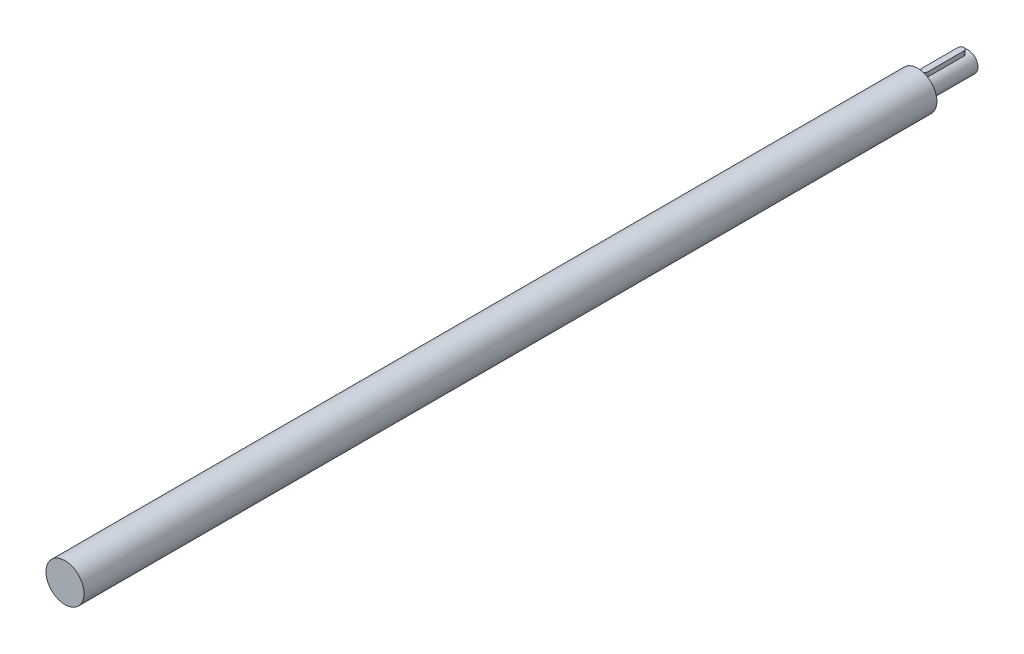
ISO-10303-21;
HEADER;
FILE_DESCRIPTION(('STEP AP214'),'2;1');
FILE_NAME('part.step','',(''),(''),'','','');
FILE_SCHEMA(('AUTOMOTIVE_DESIGN { 1 0 10303 214 1 1 1 1 }'));
ENDSEC;
DATA;
#1=APPLICATION_CONTEXT('core data for automotive mechanical design processes');
#2=APPLICATION_PROTOCOL_DEFINITION('international standard','automotive_design',2000,#1);
#3=PRODUCT_CONTEXT('',#1,'mechanical');
#4=PRODUCT('Part','Part','',(#3));
#5=PRODUCT_RELATED_PRODUCT_CATEGORY('part','',(#4));
#6=PRODUCT_DEFINITION_FORMATION('','',#4);
#7=PRODUCT_DEFINITION_CONTEXT('part definition',#1,'design');
#8=PRODUCT_DEFINITION('design','',#6,#7);
#9=PRODUCT_DEFINITION_SHAPE('','',#8);
#10=(LENGTH_UNIT() NAMED_UNIT(*) SI_UNIT(.MILLI.,.METRE.));
#11=(NAMED_UNIT(*) PLANE_ANGLE_UNIT() SI_UNIT($,.RADIAN.));
#12=(NAMED_UNIT(*) SI_UNIT($,.STERADIAN.) SOLID_ANGLE_UNIT());
#13=UNCERTAINTY_MEASURE_WITH_UNIT(LENGTH_MEASURE(1.E-05),#10,'distance_accuracy_value','');
#14=(GEOMETRIC_REPRESENTATION_CONTEXT(3) GLOBAL_UNCERTAINTY_ASSIGNED_CONTEXT((#13)) GLOBAL_UNIT_ASSIGNED_CONTEXT((#10,
#11,#12)) REPRESENTATION_CONTEXT('',''));
#15=CARTESIAN_POINT('',(0.,0.,0.));
#16=DIRECTION('',(0.,0.,1.));
#17=DIRECTION('',(1.,0.,0.));
#18=AXIS2_PLACEMENT_3D('',#15,#16,#17);
#19=CARTESIAN_POINT('',(0.,0.,425.));
#20=DIRECTION('',(0.,0.,-1.));
#21=DIRECTION('',(-1.,0.,0.));
#22=AXIS2_PLACEMENT_3D('',#19,#20,#21);
#23=CYLINDRICAL_SURFACE('',#22,9.5);
#24=CARTESIAN_POINT('',(0.,0.,425.));
#25=DIRECTION('',(0.,0.,1.));
#26=DIRECTION('',(1.,0.,0.));
#27=AXIS2_PLACEMENT_3D('',#24,#25,#26);
#28=CIRCLE('',#27,9.5);
#29=CARTESIAN_POINT('',(9.5,0.,425.));
#30=VERTEX_POINT('',#29);
#31=EDGE_CURVE('E172',#30,#30,#28,.T.);
#32=ORIENTED_EDGE('',*,*,#31,.F.);
#33=EDGE_LOOP('',(#32));
#34=FACE_BOUND('',#33,.T.);
#35=CARTESIAN_POINT('',(0.,0.,0.));
#36=DIRECTION('',(0.,0.,1.));
#37=DIRECTION('',(1.,0.,0.));
#38=AXIS2_PLACEMENT_3D('',#35,#36,#37);
#39=CIRCLE('',#38,9.5);
#40=CARTESIAN_POINT('',(9.5,0.,0.));
#41=VERTEX_POINT('',#40);
#42=EDGE_CURVE('E168',#41,#41,#39,.T.);
#43=ORIENTED_EDGE('',*,*,#42,.T.);
#44=EDGE_LOOP('',(#43));
#45=FACE_BOUND('',#44,.T.);
#46=ADVANCED_FACE('F32',(#34,#45),#23,.T.);
#47=CARTESIAN_POINT('',(0.,0.,425.));
#48=DIRECTION('',(0.,0.,1.));
#49=DIRECTION('',(1.,0.,0.));
#50=AXIS2_PLACEMENT_3D('',#47,#48,#49);
#51=PLANE('',#50);
#52=ORIENTED_EDGE('',*,*,#31,.T.);
#53=EDGE_LOOP('',(#52));
#54=FACE_BOUND('',#53,.T.);
#55=ADVANCED_FACE('F187',(#54),#51,.T.);
#56=CARTESIAN_POINT('',(0.,0.,0.));
#57=DIRECTION('',(0.,0.,1.));
#58=DIRECTION('',(1.,0.,0.));
#59=AXIS2_PLACEMENT_3D('',#56,#57,#58);
#60=PLANE('',#59);
#61=CARTESIAN_POINT('',(0.,0.,0.));
#62=DIRECTION('',(0.,0.,-1.));
#63=DIRECTION('',(-1.,0.,0.));
#64=AXIS2_PLACEMENT_3D('',#61,#62,#63);
#65=CIRCLE('',#64,5.);
#66=CARTESIAN_POINT('',(-5.,0.,0.));
#67=VERTEX_POINT('',#66);
#68=EDGE_CURVE('E169',#67,#67,#65,.T.);
#69=ORIENTED_EDGE('',*,*,#68,.F.);
#70=EDGE_LOOP('',(#69));
#71=FACE_BOUND('',#70,.T.);
#72=ORIENTED_EDGE('',*,*,#42,.F.);
#73=EDGE_LOOP('',(#72));
#74=FACE_BOUND('',#73,.T.);
#75=ADVANCED_FACE('F192',(#71,#74),#60,.F.);
#76=CARTESIAN_POINT('',(0.,0.,-25.));
#77=DIRECTION('',(0.,0.,1.));
#78=DIRECTION('',(1.,0.,0.));
#79=AXIS2_PLACEMENT_3D('',#76,#77,#78);
#80=CYLINDRICAL_SURFACE('',#79,5.);
#81=DIRECTION('',(0.,0.,1.));
#82=VECTOR('',#81,1.);
#83=CARTESIAN_POINT('',(-1.5,4.76969600708473,-25.));
#84=LINE('',#83,#82);
#85=CARTESIAN_POINT('',(-1.5,4.76969600708473,-21.5));
#86=VERTEX_POINT('',#85);
#87=CARTESIAN_POINT('',(-1.5,4.76969600708473,-3.5));
#88=VERTEX_POINT('',#87);
#89=EDGE_CURVE('E94',#86,#88,#84,.T.);
#90=ORIENTED_EDGE('',*,*,#89,.F.);
#91=CARTESIAN_POINT('',(-1.5,4.76969600708473,-21.5));
#92=CARTESIAN_POINT('',(-1.50000085359987,4.76969248993095,-21.5411808106761));
#93=CARTESIAN_POINT('',(-1.49830305374632,4.77023000663726,-21.5823408788446));
#94=CARTESIAN_POINT('',(-1.49153727481279,4.77235113343355,-21.6643467968877));
#95=CARTESIAN_POINT('',(-1.48647005385463,4.77393450820429,-21.7051927153553));
#96=CARTESIAN_POINT('',(-1.46630065235378,4.78018533002168,-21.8265960437531));
#97=CARTESIAN_POINT('',(-1.44623028637151,4.78635397305578,-21.9063090603428));
#98=CARTESIAN_POINT('',(-1.39353147335906,4.80195939037487,-22.0610342812272));
#99=CARTESIAN_POINT('',(-1.36090719903445,4.81139507864529,-22.1360480378528));
#100=CARTESIAN_POINT('',(-1.28407985018232,4.8324653260204,-22.2795943991032));
#101=CARTESIAN_POINT('',(-1.23987100279312,4.8441009806121,-22.348123749158));
#102=CARTESIAN_POINT('',(-1.13964930893702,4.86866818200433,-22.4788651690351));
#103=CARTESIAN_POINT('',(-1.08333633607985,4.88162718483485,-22.5408419504997));
#104=CARTESIAN_POINT('',(-0.961140113903202,4.90714781796852,-22.654634317974));
#105=CARTESIAN_POINT('',(-0.895255002005047,4.9197093703538,-22.7064479217769));
#106=CARTESIAN_POINT('',(-0.754090160225412,4.94333592434221,-22.7994777771676));
#107=CARTESIAN_POINT('',(-0.678642338077987,4.95436400128813,-22.840448903112));
#108=CARTESIAN_POINT('',(-0.521563369050341,4.97335005202751,-22.9090067307582));
#109=CARTESIAN_POINT('',(-0.439937649841661,4.98131068415015,-22.9366050270758));
#110=CARTESIAN_POINT('',(-0.298264456021695,4.99143710038863,-22.9712689611271));
#111=CARTESIAN_POINT('',(-0.239166490668786,4.99462764738926,-22.9820213658736));
#112=CARTESIAN_POINT('',(-0.120057391419019,4.99891817852599,-22.9963940173578));
#113=CARTESIAN_POINT('',(-0.0600465820525051,5.00001888889584,-23.0000167417284));
#114=CARTESIAN_POINT('',(0.,5.,-23.));
#115=B_SPLINE_CURVE_WITH_KNOTS('',3,(#91,#92,#93,#94,#95,#96,#97,#98,#99,#100,#101,#102,#103,
#104,#105,#106,#107,#108,#109,#110,#111,#112,#113,#114),.UNSPECIFIED.,.F.,.F.,(4,2,2,2,2,2,2,2,
2,2,2,4),(0.,0.123463321048064,0.24689887216849,0.492911372366583,0.738842172727398,
0.984895759946682,1.23795183323011,1.49105721311968,1.74947248420819,2.00766329935825,
2.1876802778492,2.36763468764484),.UNSPECIFIED.);
#116=CARTESIAN_POINT('',(0.,5.,-23.));
#117=VERTEX_POINT('',#116);
#118=EDGE_CURVE('E91',#86,#117,#115,.T.);
#119=ORIENTED_EDGE('',*,*,#118,.T.);
#120=CARTESIAN_POINT('',(0.,5.,-23.));
#121=CARTESIAN_POINT('',(0.0412230773899812,5.00000277613312,-23.0000007408743));
#122=CARTESIAN_POINT('',(0.0824255570982474,4.99948958398081,-22.998299560736));
#123=CARTESIAN_POINT('',(0.164518730866949,4.99746087704898,-22.991519584007));
#124=CARTESIAN_POINT('',(0.205409485177795,4.9959455611979,-22.9864414577623));
#125=CARTESIAN_POINT('',(0.326963301776203,4.98995381331756,-22.9662248246964));
#126=CARTESIAN_POINT('',(0.406785158642714,4.98403118606551,-22.9461036507764));
#127=CARTESIAN_POINT('',(0.561734538434264,4.96895678681408,-22.8932571208588));
#128=CARTESIAN_POINT('',(0.636863069535106,4.95980571114645,-22.8605344826837));
#129=CARTESIAN_POINT('',(0.780600785691842,4.9392243551907,-22.7834769053235));
#130=CARTESIAN_POINT('',(0.849207204843492,4.92779311423826,-22.7391370691795));
#131=CARTESIAN_POINT('',(0.97986969539363,4.90350796272656,-22.6387784335939));
#132=CARTESIAN_POINT('',(1.0417124952522,4.8906250718143,-22.5824891312811));
#133=CARTESIAN_POINT('',(1.15524422121796,4.86505948668359,-22.4603963736395));
#134=CARTESIAN_POINT('',(1.20693049442307,4.85237684556416,-22.3945904403216));
#135=CARTESIAN_POINT('',(1.29981663905891,4.82833698781928,-22.2535061687692));
#136=CARTESIAN_POINT('',(1.34075062074078,4.81701657361783,-22.1780461029315));
#137=CARTESIAN_POINT('',(1.40923482373452,4.79742985037451,-22.020945172652));
#138=CARTESIAN_POINT('',(1.43679764279335,4.78916066835566,-21.939310210108));
#139=CARTESIAN_POINT('',(1.47137173672671,4.77862845517374,-21.7977320812004));
#140=CARTESIAN_POINT('',(1.48208442594249,4.77530350348451,-21.738746300343));
#141=CARTESIAN_POINT('',(1.49640626854262,4.7708262463819,-21.6198526089327));
#142=CARTESIAN_POINT('',(1.5000169977961,4.7696734589847,-21.5599449059211));
#143=CARTESIAN_POINT('',(1.5,4.76969600708473,-21.5));
#144=B_SPLINE_CURVE_WITH_KNOTS('',3,(#120,#121,#122,#123,#124,#125,#126,#127,#128,#129,#130,
#131,#132,#133,#134,#135,#136,#137,#138,#139,#140,#141,#142,#143),.UNSPECIFIED.,.F.,.F.,(4,2,2,
2,2,2,2,2,2,2,2,4),(0.,0.123590522760266,0.247156519315276,0.493467728235494,0.739725843675749,
0.98608793095597,1.23877207809718,1.49152213929097,1.75003354782293,2.00830092246139,
2.18798745648377,2.36763411497588),.UNSPECIFIED.);
#145=CARTESIAN_POINT('',(1.5,4.76969600708473,-21.5));
#146=VERTEX_POINT('',#145);
#147=EDGE_CURVE('E11',#117,#146,#144,.T.);
#148=ORIENTED_EDGE('',*,*,#147,.T.);
#149=DIRECTION('',(0.,0.,1.));
#150=VECTOR('',#149,1.);
#151=CARTESIAN_POINT('',(1.5,4.76969600708473,-25.));
#152=LINE('',#151,#150);
#153=CARTESIAN_POINT('',(1.5,4.76969600708473,-3.5));
#154=VERTEX_POINT('',#153);
#155=EDGE_CURVE('E102',#154,#146,#152,.F.);
#156=ORIENTED_EDGE('',*,*,#155,.F.);
#157=CARTESIAN_POINT('',(1.5,4.76969600708473,-3.5));
#158=CARTESIAN_POINT('',(1.50000085359987,4.76969248993095,-3.45881918932386));
#159=CARTESIAN_POINT('',(1.49830305374632,4.77023000663726,-3.41765912115535));
#160=CARTESIAN_POINT('',(1.49153727481279,4.77235113343355,-3.33565320311231));
#161=CARTESIAN_POINT('',(1.48647005385463,4.77393450820429,-3.29480728464472));
#162=CARTESIAN_POINT('',(1.46630065235378,4.78018533002168,-3.17340395624687));
#163=CARTESIAN_POINT('',(1.44623028637151,4.78635397305578,-3.09369093965724));
#164=CARTESIAN_POINT('',(1.39353147335906,4.80195939037487,-2.93896571877284));
#165=CARTESIAN_POINT('',(1.36090719903445,4.81139507864529,-2.86395196214715));
#166=CARTESIAN_POINT('',(1.28407985018232,4.8324653260204,-2.7204056008968));
#167=CARTESIAN_POINT('',(1.23987100279312,4.8441009806121,-2.65187625084195));
#168=CARTESIAN_POINT('',(1.13964930893702,4.86866818200433,-2.52113483096489));
#169=CARTESIAN_POINT('',(1.08333633607985,4.88162718483485,-2.45915804950034));
#170=CARTESIAN_POINT('',(0.961140113903203,4.90714781796852,-2.34536568202602));
#171=CARTESIAN_POINT('',(0.895255002005049,4.91970937035379,-2.2935520782231));
#172=CARTESIAN_POINT('',(0.754090160225415,4.94333592434221,-2.2005222228324));
#173=CARTESIAN_POINT('',(0.67864233807799,4.95436400128813,-2.15955109688797));
#174=CARTESIAN_POINT('',(0.521563369050342,4.97335005202751,-2.0909932692418));
#175=CARTESIAN_POINT('',(0.439937649841662,4.98131068415015,-2.06339497292421));
#176=CARTESIAN_POINT('',(0.298264456021695,4.99143710038863,-2.02873103887292));
#177=CARTESIAN_POINT('',(0.239166490668786,4.99462764738926,-2.01797863412638));
#178=CARTESIAN_POINT('',(0.120057391419019,4.99891817852599,-2.00360598264217));
#179=CARTESIAN_POINT('',(0.0600465820525049,5.00001888889584,-1.99998325827159));
#180=CARTESIAN_POINT('',(0.,5.,-2.));
#181=B_SPLINE_CURVE_WITH_KNOTS('',3,(#157,#158,#159,#160,#161,#162,#163,#164,#165,#166,#167,
#168,#169,#170,#171,#172,#173,#174,#175,#176,#177,#178,#179,#180),.UNSPECIFIED.,.F.,.F.,(4,2,2,
2,2,2,2,2,2,2,2,4),(0.,0.123463321048067,0.246898872168487,0.492911372366583,0.738842172727397,
0.984895759946681,1.23795183323011,1.49105721311967,1.74947248420819,2.00766329935825,
2.1876802778492,2.36763468764484),.UNSPECIFIED.);
#182=CARTESIAN_POINT('',(0.,5.,-2.));
#183=VERTEX_POINT('',#182);
#184=EDGE_CURVE('E49',#154,#183,#181,.T.);
#185=ORIENTED_EDGE('',*,*,#184,.T.);
#186=CARTESIAN_POINT('',(0.,5.,-2.));
#187=CARTESIAN_POINT('',(-0.0412230773899818,5.00000277613312,-1.99999925912565));
#188=CARTESIAN_POINT('',(-0.082425557098248,4.99948958398081,-2.00170043926398));
#189=CARTESIAN_POINT('',(-0.164518730866949,4.99746087704899,-2.00848041599295));
#190=CARTESIAN_POINT('',(-0.205409485177795,4.9959455611979,-2.01355854223773));
#191=CARTESIAN_POINT('',(-0.326963301776203,4.98995381331756,-2.03377517530363));
#192=CARTESIAN_POINT('',(-0.406785158642715,4.98403118606551,-2.05389634922364));
#193=CARTESIAN_POINT('',(-0.561734538434266,4.96895678681408,-2.10674287914124));
#194=CARTESIAN_POINT('',(-0.636863069535109,4.95980571114645,-2.13946551731625));
#195=CARTESIAN_POINT('',(-0.780600785691845,4.9392243551907,-2.21652309467646));
#196=CARTESIAN_POINT('',(-0.849207204843494,4.92779311423826,-2.26086293082049));
#197=CARTESIAN_POINT('',(-0.979869695393632,4.90350796272656,-2.36122156640607));
#198=CARTESIAN_POINT('',(-1.0417124952522,4.8906250718143,-2.41751086871889));
#199=CARTESIAN_POINT('',(-1.15524422121796,4.86505948668358,-2.53960362636054));
#200=CARTESIAN_POINT('',(-1.20693049442308,4.85237684556416,-2.6054095596784));
#201=CARTESIAN_POINT('',(-1.29981663905891,4.82833698781928,-2.74649383123076));
#202=CARTESIAN_POINT('',(-1.34075062074078,4.81701657361783,-2.82195389706853));
#203=CARTESIAN_POINT('',(-1.40923482373453,4.79742985037451,-2.97905482734796));
#204=CARTESIAN_POINT('',(-1.43679764279335,4.78916066835566,-3.06068978989199));
#205=CARTESIAN_POINT('',(-1.47137173672671,4.77862845517374,-3.20226791879962));
#206=CARTESIAN_POINT('',(-1.48208442594249,4.77530350348451,-3.26125369965697));
#207=CARTESIAN_POINT('',(-1.49640626854262,4.7708262463819,-3.38014739106727));
#208=CARTESIAN_POINT('',(-1.5000169977961,4.7696734589847,-3.44005509407891));
#209=CARTESIAN_POINT('',(-1.5,4.76969600708473,-3.5));
#210=B_SPLINE_CURVE_WITH_KNOTS('',3,(#186,#187,#188,#189,#190,#191,#192,#193,#194,#195,#196,
#197,#198,#199,#200,#201,#202,#203,#204,#205,#206,#207,#208,#209),.UNSPECIFIED.,.F.,.F.,(4,2,2,
2,2,2,2,2,2,2,2,4),(0.,0.123590522760266,0.247156519315276,0.493467728235495,0.739725843675752,
0.986087930955972,1.23877207809718,1.49152213929098,1.75003354782293,2.00830092246139,
2.18798745648376,2.36763411497588),.UNSPECIFIED.);
#211=EDGE_CURVE('E42',#183,#88,#210,.T.);
#212=ORIENTED_EDGE('',*,*,#211,.T.);
#213=EDGE_LOOP('',(#90,#119,#148,#156,#185,#212));
#214=FACE_BOUND('',#213,.T.);
#215=CARTESIAN_POINT('',(0.,0.,-25.));
#216=DIRECTION('',(0.,0.,-1.));
#217=DIRECTION('',(-1.,0.,0.));
#218=AXIS2_PLACEMENT_3D('',#215,#216,#217);
#219=CIRCLE('',#218,5.);
#220=CARTESIAN_POINT('',(-5.,0.,-25.));
#221=VERTEX_POINT('',#220);
#222=EDGE_CURVE('E162',#221,#221,#219,.T.);
#223=ORIENTED_EDGE('',*,*,#222,.F.);
#224=EDGE_LOOP('',(#223));
#225=FACE_BOUND('',#224,.T.);
#226=ORIENTED_EDGE('',*,*,#68,.T.);
#227=EDGE_LOOP('',(#226));
#228=FACE_BOUND('',#227,.T.);
#229=ADVANCED_FACE('F92',(#214,#225,#228),#80,.T.);
#230=CARTESIAN_POINT('',(0.,0.,-25.));
#231=DIRECTION('',(0.,0.,-1.));
#232=DIRECTION('',(-1.,0.,0.));
#233=AXIS2_PLACEMENT_3D('',#230,#231,#232);
#234=PLANE('',#233);
#235=ORIENTED_EDGE('',*,*,#222,.T.);
#236=EDGE_LOOP('',(#235));
#237=FACE_BOUND('',#236,.T.);
#238=ADVANCED_FACE('F203',(#237),#234,.T.);
#239=CARTESIAN_POINT('',(1.5,0.,-23.));
#240=DIRECTION('',(-1.,0.,0.));
#241=DIRECTION('',(0.,-1.,0.));
#242=AXIS2_PLACEMENT_3D('',#239,#240,#241);
#243=PLANE('',#242);
#244=DIRECTION('',(0.,0.,1.));
#245=VECTOR('',#244,1.);
#246=CARTESIAN_POINT('',(1.5,7.,-23.));
#247=LINE('',#246,#245);
#248=CARTESIAN_POINT('',(1.5,7.,-21.5));
#249=VERTEX_POINT('',#248);
#250=CARTESIAN_POINT('',(1.5,7.,-3.50000000000001));
#251=VERTEX_POINT('',#250);
#252=EDGE_CURVE('E156',#249,#251,#247,.T.);
#253=ORIENTED_EDGE('',*,*,#252,.T.);
#254=DIRECTION('',(0.,-1.,0.));
#255=VECTOR('',#254,1.);
#256=CARTESIAN_POINT('',(1.5,0.,-3.5));
#257=LINE('',#256,#255);
#258=EDGE_CURVE('E149',#251,#154,#257,.T.);
#259=ORIENTED_EDGE('',*,*,#258,.T.);
#260=ORIENTED_EDGE('',*,*,#155,.T.);
#261=DIRECTION('',(0.,-1.,0.));
#262=VECTOR('',#261,1.);
#263=CARTESIAN_POINT('',(1.5,7.,-21.5));
#264=LINE('',#263,#262);
#265=EDGE_CURVE('E88',#146,#249,#264,.F.);
#266=ORIENTED_EDGE('',*,*,#265,.T.);
#267=EDGE_LOOP('',(#253,#259,#260,#266));
#268=FACE_BOUND('',#267,.T.);
#269=ADVANCED_FACE('F155',(#268),#243,.F.);
#270=CARTESIAN_POINT('',(-1.5,0.,-23.));
#271=DIRECTION('',(1.,0.,0.));
#272=DIRECTION('',(0.,1.,0.));
#273=AXIS2_PLACEMENT_3D('',#270,#271,#272);
#274=PLANE('',#273);
#275=ORIENTED_EDGE('',*,*,#89,.T.);
#276=DIRECTION('',(0.,1.,0.));
#277=VECTOR('',#276,1.);
#278=CARTESIAN_POINT('',(-1.5,0.,-3.5));
#279=LINE('',#278,#277);
#280=CARTESIAN_POINT('',(-1.5,7.,-3.50000000000001));
#281=VERTEX_POINT('',#280);
#282=EDGE_CURVE('E136',#88,#281,#279,.T.);
#283=ORIENTED_EDGE('',*,*,#282,.T.);
#284=DIRECTION('',(0.,0.,1.));
#285=VECTOR('',#284,1.);
#286=CARTESIAN_POINT('',(-1.5,7.,-23.));
#287=LINE('',#286,#285);
#288=CARTESIAN_POINT('',(-1.5,7.,-21.5));
#289=VERTEX_POINT('',#288);
#290=EDGE_CURVE('E159',#289,#281,#287,.T.);
#291=ORIENTED_EDGE('',*,*,#290,.F.);
#292=DIRECTION('',(0.,1.,0.));
#293=VECTOR('',#292,1.);
#294=CARTESIAN_POINT('',(-1.5,4.76969600708473,-21.5));
#295=LINE('',#294,#293);
#296=EDGE_CURVE('E97',#289,#86,#295,.F.);
#297=ORIENTED_EDGE('',*,*,#296,.T.);
#298=EDGE_LOOP('',(#275,#283,#291,#297));
#299=FACE_BOUND('',#298,.T.);
#300=ADVANCED_FACE('F178',(#299),#274,.F.);
#301=CARTESIAN_POINT('',(-1.5,7.,-23.));
#302=DIRECTION('',(0.,-1.,0.));
#303=DIRECTION('',(1.,0.,0.));
#304=AXIS2_PLACEMENT_3D('',#301,#302,#303);
#305=PLANE('',#304);
#306=CARTESIAN_POINT('',(0.,7.,-3.5));
#307=DIRECTION('',(0.,-1.,0.));
#308=DIRECTION('',(1.,0.,0.));
#309=AXIS2_PLACEMENT_3D('',#306,#307,#308);
#310=CIRCLE('',#309,1.5);
#311=CARTESIAN_POINT('',(0.,7.,-2.));
#312=VERTEX_POINT('',#311);
#313=EDGE_CURVE('E146',#281,#312,#310,.F.);
#314=ORIENTED_EDGE('',*,*,#313,.T.);
#315=CARTESIAN_POINT('',(0.,7.,-3.5));
#316=DIRECTION('',(0.,-1.,0.));
#317=DIRECTION('',(1.,0.,0.));
#318=AXIS2_PLACEMENT_3D('',#315,#316,#317);
#319=CIRCLE('',#318,1.5);
#320=EDGE_CURVE('E144',#312,#251,#319,.F.);
#321=ORIENTED_EDGE('',*,*,#320,.T.);
#322=ORIENTED_EDGE('',*,*,#252,.F.);
#323=CARTESIAN_POINT('',(0.,7.,-21.5));
#324=DIRECTION('',(0.,-1.,0.));
#325=DIRECTION('',(1.,0.,0.));
#326=AXIS2_PLACEMENT_3D('',#323,#324,#325);
#327=CIRCLE('',#326,1.5);
#328=CARTESIAN_POINT('',(0.,7.,-23.));
#329=VERTEX_POINT('',#328);
#330=EDGE_CURVE('E148',#249,#329,#327,.F.);
#331=ORIENTED_EDGE('',*,*,#330,.T.);
#332=CARTESIAN_POINT('',(0.,7.,-21.5));
#333=DIRECTION('',(0.,-1.,0.));
#334=DIRECTION('',(1.,0.,0.));
#335=AXIS2_PLACEMENT_3D('',#332,#333,#334);
#336=CIRCLE('',#335,1.5);
#337=EDGE_CURVE('E101',#329,#289,#336,.F.);
#338=ORIENTED_EDGE('',*,*,#337,.T.);
#339=ORIENTED_EDGE('',*,*,#290,.T.);
#340=EDGE_LOOP('',(#314,#321,#322,#331,#338,#339));
#341=FACE_BOUND('',#340,.T.);
#342=ADVANCED_FACE('F123',(#341),#305,.F.);
#343=CARTESIAN_POINT('',(0.,0.,-21.5));
#344=DIRECTION('',(0.,-1.,0.));
#345=DIRECTION('',(1.,0.,0.));
#346=AXIS2_PLACEMENT_3D('',#343,#344,#345);
#347=CYLINDRICAL_SURFACE('',#346,1.5);
#348=ORIENTED_EDGE('',*,*,#118,.F.);
#349=ORIENTED_EDGE('',*,*,#296,.F.);
#350=ORIENTED_EDGE('',*,*,#337,.F.);
#351=DIRECTION('',(0.,1.,0.));
#352=VECTOR('',#351,1.);
#353=CARTESIAN_POINT('',(0.,7.,-23.));
#354=LINE('',#353,#352);
#355=EDGE_CURVE('E87',#117,#329,#354,.T.);
#356=ORIENTED_EDGE('',*,*,#355,.F.);
#357=EDGE_LOOP('',(#348,#349,#350,#356));
#358=FACE_BOUND('',#357,.T.);
#359=ADVANCED_FACE('F100',(#358),#347,.T.);
#360=CARTESIAN_POINT('',(0.,0.,-3.5));
#361=DIRECTION('',(0.,1.,0.));
#362=DIRECTION('',(-1.,0.,0.));
#363=AXIS2_PLACEMENT_3D('',#360,#361,#362);
#364=CYLINDRICAL_SURFACE('',#363,1.5);
#365=DIRECTION('',(0.,1.,0.));
#366=VECTOR('',#365,1.);
#367=CARTESIAN_POINT('',(0.,0.,-2.));
#368=LINE('',#367,#366);
#369=EDGE_CURVE('E37',#312,#183,#368,.F.);
#370=ORIENTED_EDGE('',*,*,#369,.F.);
#371=ORIENTED_EDGE('',*,*,#313,.F.);
#372=ORIENTED_EDGE('',*,*,#282,.F.);
#373=ORIENTED_EDGE('',*,*,#211,.F.);
#374=EDGE_LOOP('',(#370,#371,#372,#373));
#375=FACE_BOUND('',#374,.T.);
#376=ADVANCED_FACE('F122',(#375),#364,.T.);
#377=CARTESIAN_POINT('',(0.,0.,-3.5));
#378=DIRECTION('',(0.,-1.,0.));
#379=DIRECTION('',(1.,0.,0.));
#380=AXIS2_PLACEMENT_3D('',#377,#378,#379);
#381=CYLINDRICAL_SURFACE('',#380,1.5);
#382=ORIENTED_EDGE('',*,*,#320,.F.);
#383=ORIENTED_EDGE('',*,*,#369,.T.);
#384=ORIENTED_EDGE('',*,*,#184,.F.);
#385=ORIENTED_EDGE('',*,*,#258,.F.);
#386=EDGE_LOOP('',(#382,#383,#384,#385));
#387=FACE_BOUND('',#386,.T.);
#388=ADVANCED_FACE('F125',(#387),#381,.T.);
#389=CARTESIAN_POINT('',(0.,0.,-21.5));
#390=DIRECTION('',(0.,1.,0.));
#391=DIRECTION('',(-1.,0.,0.));
#392=AXIS2_PLACEMENT_3D('',#389,#390,#391);
#393=CYLINDRICAL_SURFACE('',#392,1.5);
#394=ORIENTED_EDGE('',*,*,#330,.F.);
#395=ORIENTED_EDGE('',*,*,#265,.F.);
#396=ORIENTED_EDGE('',*,*,#147,.F.);
#397=ORIENTED_EDGE('',*,*,#355,.T.);
#398=EDGE_LOOP('',(#394,#395,#396,#397));
#399=FACE_BOUND('',#398,.T.);
#400=ADVANCED_FACE('F34',(#399),#393,.T.);
#401=CLOSED_SHELL('',(#46,#55,#75,#229,#238,#269,#300,#342,#359,#376,#388,#400));
#402=MANIFOLD_SOLID_BREP('B2',#401);
#403=ADVANCED_BREP_SHAPE_REPRESENTATION('',(#18,#402),#14);
#404=SHAPE_DEFINITION_REPRESENTATION(#9,#403);
ENDSEC;
END-ISO-10303-21;
